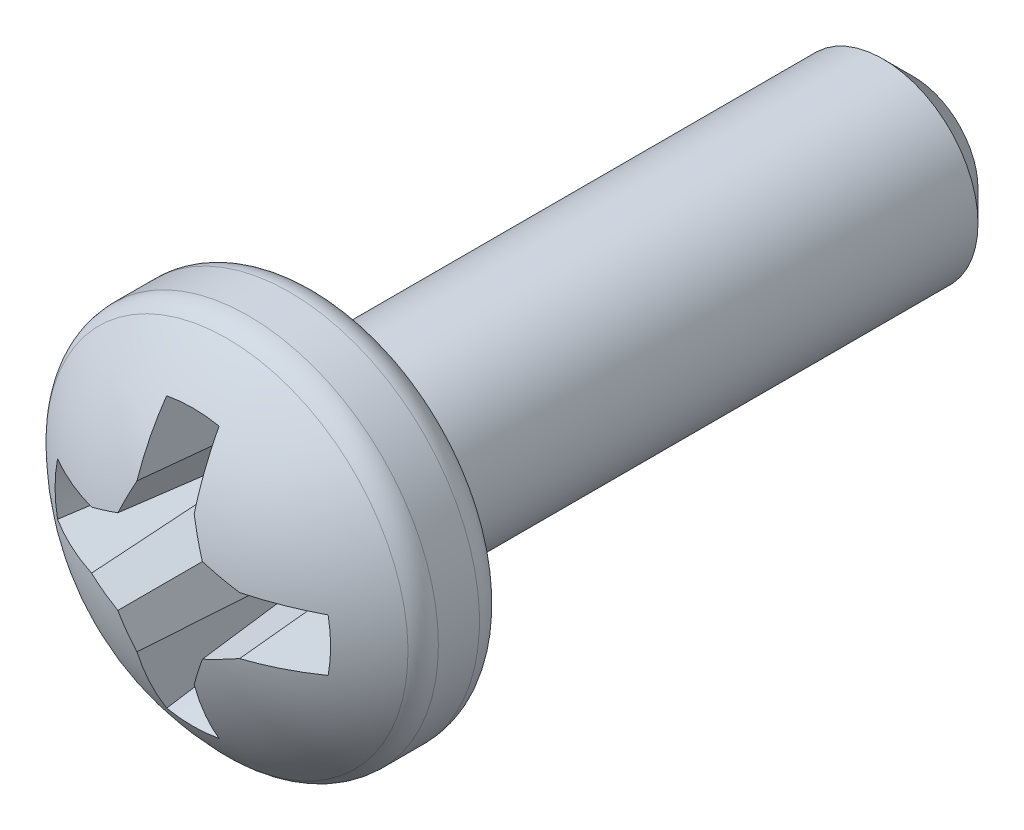
ISO-10303-21;
HEADER;
FILE_DESCRIPTION(('STEP AP214'),'2;1');
FILE_NAME('part.step','',(''),(''),'','','');
FILE_SCHEMA(('AUTOMOTIVE_DESIGN { 1 0 10303 214 1 1 1 1 }'));
ENDSEC;
DATA;
#1=APPLICATION_CONTEXT('core data for automotive mechanical design processes');
#2=APPLICATION_PROTOCOL_DEFINITION('international standard','automotive_design',2000,#1);
#3=PRODUCT_CONTEXT('',#1,'mechanical');
#4=PRODUCT('Part','Part','',(#3));
#5=PRODUCT_RELATED_PRODUCT_CATEGORY('part','',(#4));
#6=PRODUCT_DEFINITION_FORMATION('','',#4);
#7=PRODUCT_DEFINITION_CONTEXT('part definition',#1,'design');
#8=PRODUCT_DEFINITION('design','',#6,#7);
#9=PRODUCT_DEFINITION_SHAPE('','',#8);
#10=(LENGTH_UNIT() NAMED_UNIT(*) SI_UNIT(.MILLI.,.METRE.));
#11=(NAMED_UNIT(*) PLANE_ANGLE_UNIT() SI_UNIT($,.RADIAN.));
#12=(NAMED_UNIT(*) SI_UNIT($,.STERADIAN.) SOLID_ANGLE_UNIT());
#13=UNCERTAINTY_MEASURE_WITH_UNIT(LENGTH_MEASURE(1.E-05),#10,'distance_accuracy_value','');
#14=(GEOMETRIC_REPRESENTATION_CONTEXT(3) GLOBAL_UNCERTAINTY_ASSIGNED_CONTEXT((#13)) GLOBAL_UNIT_ASSIGNED_CONTEXT((#10,
#11,#12)) REPRESENTATION_CONTEXT('',''));
#15=CARTESIAN_POINT('',(0.,0.,0.));
#16=DIRECTION('',(0.,0.,1.));
#17=DIRECTION('',(1.,0.,0.));
#18=AXIS2_PLACEMENT_3D('',#15,#16,#17);
#19=CARTESIAN_POINT('',(0.710478325384203,0.791461441644268,0.413196607862429));
#20=DIRECTION('',(0.,0.,1.));
#21=DIRECTION('',(1.,0.,0.));
#22=AXIS2_PLACEMENT_3D('',#19,#20,#21);
#23=PLANE('',#22);
#24=DIRECTION('',(0.382683432365081,-0.92387953251129,0.));
#25=VECTOR('',#24,1.);
#26=CARTESIAN_POINT('',(0.723792212154071,0.796976234112247,0.413196607862429));
#27=LINE('',#26,#25);
#28=CARTESIAN_POINT('',(0.716221966738697,0.815252423264536,0.413196607862429));
#29=VERTEX_POINT('',#28);
#30=CARTESIAN_POINT('',(0.721507910320162,0.802491026580226,0.413196607862429));
#31=VERTEX_POINT('',#30);
#32=EDGE_CURVE('E292',#29,#31,#27,.T.);
#33=ORIENTED_EDGE('',*,*,#32,.F.);
#34=DIRECTION('',(0.,1.,0.));
#35=VECTOR('',#34,1.);
#36=CARTESIAN_POINT('',(0.716221966738698,0.791461441644268,0.413196607862429));
#37=LINE('',#36,#35);
#38=CARTESIAN_POINT('',(0.716221966738698,0.827667770303817,0.413196607862429));
#39=VERTEX_POINT('',#38);
#40=EDGE_CURVE('E168',#39,#29,#37,.F.);
#41=ORIENTED_EDGE('',*,*,#40,.F.);
#42=CARTESIAN_POINT('',(0.710478325384203,0.791461441644268,0.413196607862429));
#43=DIRECTION('',(0.,0.,1.));
#44=DIRECTION('',(1.,0.,0.));
#45=AXIS2_PLACEMENT_3D('',#42,#43,#44);
#46=CIRCLE('',#45,0.0366590732426823);
#47=CARTESIAN_POINT('',(0.704734684029712,0.827667770303818,0.413196607862429));
#48=VERTEX_POINT('',#47);
#49=EDGE_CURVE('E159',#39,#48,#46,.T.);
#50=ORIENTED_EDGE('',*,*,#49,.T.);
#51=DIRECTION('',(0.,1.,0.));
#52=VECTOR('',#51,1.);
#53=CARTESIAN_POINT('',(0.704734684029713,0.791461441644271,0.413196607862429));
#54=LINE('',#53,#52);
#55=CARTESIAN_POINT('',(0.704734684029713,0.815252423264539,0.413196607862429));
#56=VERTEX_POINT('',#55);
#57=EDGE_CURVE('E166',#56,#48,#54,.T.);
#58=ORIENTED_EDGE('',*,*,#57,.F.);
#59=DIRECTION('',(0.382683432365079,0.923879532511291,0.));
#60=VECTOR('',#59,1.);
#61=CARTESIAN_POINT('',(0.697164438614339,0.79697623411225,0.413196607862429));
#62=LINE('',#61,#60);
#63=CARTESIAN_POINT('',(0.699448740448248,0.802491026580229,0.413196607862429));
#64=VERTEX_POINT('',#63);
#65=EDGE_CURVE('E301',#64,#56,#62,.T.);
#66=ORIENTED_EDGE('',*,*,#65,.F.);
#67=DIRECTION('',(0.923879532511289,0.382683432365086,0.));
#68=VECTOR('',#67,1.);
#69=CARTESIAN_POINT('',(0.704963532916228,0.804775328414139,0.413196607862429));
#70=LINE('',#69,#68);
#71=CARTESIAN_POINT('',(0.686687343763938,0.797205082998765,0.413196607862429));
#72=VERTEX_POINT('',#71);
#73=EDGE_CURVE('E307',#72,#64,#70,.T.);
#74=ORIENTED_EDGE('',*,*,#73,.F.);
#75=DIRECTION('',(1.,0.,0.));
#76=VECTOR('',#75,1.);
#77=CARTESIAN_POINT('',(0.710478325384207,0.797205082998765,0.413196607862429));
#78=LINE('',#77,#76);
#79=CARTESIAN_POINT('',(0.674271996676527,0.797205082997996,0.413196607853642));
#80=VERTEX_POINT('',#79);
#81=EDGE_CURVE('E313',#80,#72,#78,.T.);
#82=ORIENTED_EDGE('',*,*,#81,.F.);
#83=CARTESIAN_POINT('',(0.710478325384206,0.791461441644271,0.413196607862429));
#84=DIRECTION('',(0.,0.,1.));
#85=DIRECTION('',(1.,0.,0.));
#86=AXIS2_PLACEMENT_3D('',#83,#84,#85);
#87=CIRCLE('',#86,0.0366590732924525);
#88=CARTESIAN_POINT('',(0.674271996674264,0.78571780028978,0.413196607862429));
#89=VERTEX_POINT('',#88);
#90=EDGE_CURVE('E410',#80,#89,#87,.T.);
#91=ORIENTED_EDGE('',*,*,#90,.T.);
#92=DIRECTION('',(1.,0.,0.));
#93=VECTOR('',#92,1.);
#94=CARTESIAN_POINT('',(0.710478325384203,0.78571780028978,0.413196607862429));
#95=LINE('',#94,#93);
#96=CARTESIAN_POINT('',(0.686687343763935,0.78571780028978,0.413196607862429));
#97=VERTEX_POINT('',#96);
#98=EDGE_CURVE('E247',#97,#89,#95,.F.);
#99=ORIENTED_EDGE('',*,*,#98,.F.);
#100=DIRECTION('',(-0.923879532511292,0.382683432365076,0.));
#101=VECTOR('',#100,1.);
#102=CARTESIAN_POINT('',(0.704963532916224,0.778147554874406,0.413196607862429));
#103=LINE('',#102,#101);
#104=CARTESIAN_POINT('',(0.699448740448245,0.780431856708316,0.413196607862429));
#105=VERTEX_POINT('',#104);
#106=EDGE_CURVE('E248',#105,#97,#103,.T.);
#107=ORIENTED_EDGE('',*,*,#106,.F.);
#108=DIRECTION('',(-0.38268343236509,0.923879532511287,0.));
#109=VECTOR('',#108,1.);
#110=CARTESIAN_POINT('',(0.697164438614334,0.785946649176296,0.413196607862429));
#111=LINE('',#110,#109);
#112=CARTESIAN_POINT('',(0.704734684029709,0.767670460024005,0.413196607862429));
#113=VERTEX_POINT('',#112);
#114=EDGE_CURVE('E254',#113,#105,#111,.T.);
#115=ORIENTED_EDGE('',*,*,#114,.F.);
#116=DIRECTION('',(0.,1.,0.));
#117=VECTOR('',#116,1.);
#118=CARTESIAN_POINT('',(0.704734684029709,0.791461441644275,0.413196607862429));
#119=LINE('',#118,#117);
#120=CARTESIAN_POINT('',(0.70473468402971,0.755255112984727,0.413196607862429));
#121=VERTEX_POINT('',#120);
#122=EDGE_CURVE('E260',#121,#113,#119,.T.);
#123=ORIENTED_EDGE('',*,*,#122,.F.);
#124=CARTESIAN_POINT('',(0.710478325384204,0.791461441644275,0.413196607862429));
#125=DIRECTION('',(0.,0.,1.));
#126=DIRECTION('',(1.,0.,0.));
#127=AXIS2_PLACEMENT_3D('',#124,#125,#126);
#128=CIRCLE('',#127,0.0366590732426806);
#129=CARTESIAN_POINT('',(0.716221966738695,0.755255112984727,0.413196607862429));
#130=VERTEX_POINT('',#129);
#131=EDGE_CURVE('E336',#121,#130,#128,.T.);
#132=ORIENTED_EDGE('',*,*,#131,.T.);
#133=DIRECTION('',(0.,1.,0.));
#134=VECTOR('',#133,1.);
#135=CARTESIAN_POINT('',(0.716221966738694,0.791461441644272,0.413196607862429));
#136=LINE('',#135,#134);
#137=CARTESIAN_POINT('',(0.716221966738695,0.767670460024002,0.413196607862429));
#138=VERTEX_POINT('',#137);
#139=EDGE_CURVE('E266',#138,#130,#136,.F.);
#140=ORIENTED_EDGE('',*,*,#139,.F.);
#141=DIRECTION('',(-0.382683432365075,-0.923879532511293,0.));
#142=VECTOR('',#141,1.);
#143=CARTESIAN_POINT('',(0.723792212154069,0.785946649176293,0.413196607862429));
#144=LINE('',#143,#142);
#145=CARTESIAN_POINT('',(0.721507910320159,0.780431856708313,0.413196607862429));
#146=VERTEX_POINT('',#145);
#147=EDGE_CURVE('E267',#146,#138,#144,.T.);
#148=ORIENTED_EDGE('',*,*,#147,.F.);
#149=DIRECTION('',(-0.923879532511286,-0.382683432365092,0.));
#150=VECTOR('',#149,1.);
#151=CARTESIAN_POINT('',(0.715993117852179,0.778147554874402,0.413196607862429));
#152=LINE('',#151,#150);
#153=CARTESIAN_POINT('',(0.734269307004469,0.785717800289777,0.413196607862429));
#154=VERTEX_POINT('',#153);
#155=EDGE_CURVE('E273',#154,#146,#152,.T.);
#156=ORIENTED_EDGE('',*,*,#155,.F.);
#157=DIRECTION('',(1.,0.,0.));
#158=VECTOR('',#157,1.);
#159=CARTESIAN_POINT('',(0.7104783253842,0.785717800289777,0.413196607862429));
#160=LINE('',#159,#158);
#161=CARTESIAN_POINT('',(0.746684654043753,0.785717800289777,0.413196607862429));
#162=VERTEX_POINT('',#161);
#163=EDGE_CURVE('E279',#162,#154,#160,.F.);
#164=ORIENTED_EDGE('',*,*,#163,.F.);
#165=CARTESIAN_POINT('',(0.710478325384203,0.791461441644268,0.413196607862429));
#166=DIRECTION('',(0.,0.,1.));
#167=DIRECTION('',(1.,0.,0.));
#168=AXIS2_PLACEMENT_3D('',#165,#166,#167);
#169=CIRCLE('',#168,0.0366590732426823);
#170=CARTESIAN_POINT('',(0.746684654043752,0.797205082998762,0.413196607862429));
#171=VERTEX_POINT('',#170);
#172=EDGE_CURVE('E492',#162,#171,#169,.T.);
#173=ORIENTED_EDGE('',*,*,#172,.T.);
#174=DIRECTION('',(1.,0.,0.));
#175=VECTOR('',#174,1.);
#176=CARTESIAN_POINT('',(0.710478325384203,0.797205082998762,0.413196607862429));
#177=LINE('',#176,#175);
#178=CARTESIAN_POINT('',(0.734269307004472,0.797205082998762,0.413196607862429));
#179=VERTEX_POINT('',#178);
#180=EDGE_CURVE('E285',#179,#171,#177,.T.);
#181=ORIENTED_EDGE('',*,*,#180,.F.);
#182=DIRECTION('',(0.92387953251129,-0.382683432365083,0.));
#183=VECTOR('',#182,1.);
#184=CARTESIAN_POINT('',(0.715993117852182,0.804775328414136,0.413196607862429));
#185=LINE('',#184,#183);
#186=EDGE_CURVE('E286',#31,#179,#185,.T.);
#187=ORIENTED_EDGE('',*,*,#186,.F.);
#188=EDGE_LOOP('',(#33,#41,#50,#58,#66,#74,#82,#91,#99,#107,#115,#123,#132,#140,#148,#156,#164,
#173,#181,#187));
#189=FACE_BOUND('',#188,.T.);
#190=ADVANCED_FACE('F17',(#189),#23,.T.);
#191=CARTESIAN_POINT('',(0.710478325384207,0.801303961329311,0.460047001563216));
#192=DIRECTION('',(0.,-0.996194698091744,0.0871557427476727));
#193=DIRECTION('',(0.,-0.0871557427476727,-0.996194698091744));
#194=AXIS2_PLACEMENT_3D('',#191,#192,#193);
#195=PLANE('',#194);
#196=DIRECTION('',(0.0173337504938649,-0.0871426484044482,-0.996045029063885));
#197=VECTOR('',#196,1.);
#198=CARTESIAN_POINT('',(0.685943943259578,0.8009424097128,0.455914447676356));
#199=LINE('',#198,#197);
#200=CARTESIAN_POINT('',(0.685943943259578,0.8009424097128,0.455914447676356));
#201=VERTEX_POINT('',#200);
#202=EDGE_CURVE('E310',#201,#72,#199,.T.);
#203=ORIENTED_EDGE('',*,*,#202,.F.);
#204=CARTESIAN_POINT('',(0.6656306923124,0.80015108887588,0.446869609122098));
#205=CARTESIAN_POINT('',(0.668819051995565,0.800321424804083,0.448816557690383));
#206=CARTESIAN_POINT('',(0.672106002749407,0.800472536171256,0.450543768520713));
#207=CARTESIAN_POINT('',(0.678877086398445,0.800736309783544,0.453558714705461));
#208=CARTESIAN_POINT('',(0.682361219293641,0.800848972028658,0.45484645005988));
#209=CARTESIAN_POINT('',(0.685943943259514,0.800942409712743,0.455914447676343));
#210=B_SPLINE_CURVE_WITH_KNOTS('',3,(#204,#205,#206,#207,#208,#209),.UNSPECIFIED.,.F.,.F.,(4,2,
4),(0.,0.0111485978671279,0.0222971957342559),.UNSPECIFIED.);
#211=CARTESIAN_POINT('',(0.665630692322977,0.800151088874493,0.446869609106245));
#212=VERTEX_POINT('',#211);
#213=EDGE_CURVE('E409',#212,#201,#210,.T.);
#214=ORIENTED_EDGE('',*,*,#213,.F.);
#215=CARTESIAN_POINT('',(0.665630692333555,0.800151088873107,0.446869609090391));
#216=CARTESIAN_POINT('',(0.667067160111317,0.79966000435443,0.441256487356838));
#217=CARTESIAN_POINT('',(0.668505502686871,0.799168961608414,0.435643843086986));
#218=CARTESIAN_POINT('',(0.671385937468524,0.798186959649785,0.424419509338453));
#219=CARTESIAN_POINT('',(0.672828029674714,0.797696000437175,0.418807819859794));
#220=CARTESIAN_POINT('',(0.674271996678788,0.797205082997228,0.41319660784486));
#221=B_SPLINE_CURVE_WITH_KNOTS('',3,(#215,#216,#217,#218,#219,#220),.UNSPECIFIED.,.F.,.F.,(4,2,
4),(0.,0.0174443558891329,0.0348887122017161),.UNSPECIFIED.);
#222=EDGE_CURVE('E318',#212,#80,#221,.T.);
#223=ORIENTED_EDGE('',*,*,#222,.T.);
#224=ORIENTED_EDGE('',*,*,#81,.T.);
#225=EDGE_LOOP('',(#203,#214,#223,#224));
#226=FACE_BOUND('',#225,.T.);
#227=ADVANCED_FACE('F427',(#226),#195,.T.);
#228=CARTESIAN_POINT('',(0.703394960087848,0.808562198209984,0.460047001563216));
#229=DIRECTION('',(0.381227206369649,-0.920363891963225,0.0871557427476661));
#230=DIRECTION('',(0.923879532511289,0.382683432365086,0.));
#231=AXIS2_PLACEMENT_3D('',#228,#229,#230);
#232=PLANE('',#231);
#233=DIRECTION('',(0.0666626913468223,-0.0666626913468416,-0.995546167269401));
#234=VECTOR('',#233,1.);
#235=CARTESIAN_POINT('',(0.696466961696687,0.805472805331791,0.457726739301586));
#236=LINE('',#235,#234);
#237=CARTESIAN_POINT('',(0.696466961696687,0.805472805331791,0.457726739301586));
#238=VERTEX_POINT('',#237);
#239=EDGE_CURVE('E304',#238,#64,#236,.T.);
#240=ORIENTED_EDGE('',*,*,#239,.F.);
#241=CARTESIAN_POINT('',(0.685943943259578,0.8009424097128,0.455914447676356));
#242=CARTESIAN_POINT('',(0.687674312814513,0.801700049456702,0.456346321822599));
#243=CARTESIAN_POINT('',(0.689416415795073,0.802456402296903,0.456713283197823));
#244=CARTESIAN_POINT('',(0.692924088607443,0.8039665341699,0.457317380406233));
#245=CARTESIAN_POINT('',(0.694689658439253,0.804720313202697,0.457554516239419));
#246=CARTESIAN_POINT('',(0.696466961696687,0.805472805331791,0.457726739301586));
#247=B_SPLINE_CURVE_WITH_KNOTS('',3,(#241,#242,#243,#244,#245,#246),.UNSPECIFIED.,.F.,.F.,(4,2,
4),(0.,0.00580300590917787,0.0116060118183554),.UNSPECIFIED.);
#248=EDGE_CURVE('E439',#201,#238,#247,.T.);
#249=ORIENTED_EDGE('',*,*,#248,.F.);
#250=ORIENTED_EDGE('',*,*,#202,.T.);
#251=ORIENTED_EDGE('',*,*,#73,.T.);
#252=EDGE_LOOP('',(#240,#249,#250,#251));
#253=FACE_BOUND('',#252,.T.);
#254=ADVANCED_FACE('F431',(#253),#232,.T.);
#255=CARTESIAN_POINT('',(0.693377568818494,0.79854480694063,0.460047001563216));
#256=DIRECTION('',(0.920363891963229,-0.381227206369643,0.0871557427476506));
#257=DIRECTION('',(0.382683432365079,0.923879532511291,0.));
#258=AXIS2_PLACEMENT_3D('',#255,#256,#257);
#259=PLANE('',#258);
#260=DIRECTION('',(0.0871426484044276,-0.0173337504938855,-0.996045029063886));
#261=VECTOR('',#260,1.);
#262=CARTESIAN_POINT('',(0.700997357315678,0.8159958237689,0.455914447676355));
#263=LINE('',#262,#261);
#264=CARTESIAN_POINT('',(0.700997357315678,0.8159958237689,0.455914447676355));
#265=VERTEX_POINT('',#264);
#266=EDGE_CURVE('E176',#265,#56,#263,.T.);
#267=ORIENTED_EDGE('',*,*,#266,.F.);
#268=CARTESIAN_POINT('',(0.696466961696687,0.805472805331791,0.457726739301586));
#269=CARTESIAN_POINT('',(0.697219453825782,0.807250108589226,0.457554516239419));
#270=CARTESIAN_POINT('',(0.697973232858578,0.809015678421036,0.457317380406232));
#271=CARTESIAN_POINT('',(0.699483364731575,0.812523351233405,0.456713283197822));
#272=CARTESIAN_POINT('',(0.700239717571775,0.814265454213965,0.456346321822598));
#273=CARTESIAN_POINT('',(0.700997357315678,0.8159958237689,0.455914447676355));
#274=B_SPLINE_CURVE_WITH_KNOTS('',3,(#268,#269,#270,#271,#272,#273),.UNSPECIFIED.,.F.,.F.,(4,2,
4),(0.,0.00580300590917771,0.0116060118183554),.UNSPECIFIED.);
#275=EDGE_CURVE('E445',#238,#265,#274,.T.);
#276=ORIENTED_EDGE('',*,*,#275,.F.);
#277=ORIENTED_EDGE('',*,*,#239,.T.);
#278=ORIENTED_EDGE('',*,*,#65,.T.);
#279=EDGE_LOOP('',(#267,#276,#277,#278));
#280=FACE_BOUND('',#279,.T.);
#281=ADVANCED_FACE('F436',(#280),#259,.T.);
#282=CARTESIAN_POINT('',(0.700635805699168,0.791461441644271,0.460047001563216));
#283=DIRECTION('',(0.996194698091747,0.,0.0871557427476441));
#284=DIRECTION('',(0.0871557427476441,0.,-0.996194698091747));
#285=AXIS2_PLACEMENT_3D('',#282,#283,#284);
#286=PLANE('',#285);
#287=CARTESIAN_POINT('',(0.704734684027888,0.827667770309186,0.413196607883283));
#288=CARTESIAN_POINT('',(0.704243766588092,0.829111737320114,0.41880781989649));
#289=CARTESIAN_POINT('',(0.703752807375633,0.830553829533185,0.424419509373417));
#290=CARTESIAN_POINT('',(0.702770805417309,0.833434264328652,0.43564384311848));
#291=CARTESIAN_POINT('',(0.702279762671445,0.834872606911139,0.441256487386592));
#292=CARTESIAN_POINT('',(0.701788678152921,0.836309074695859,0.446869609118402));
#293=B_SPLINE_CURVE_WITH_KNOTS('',3,(#287,#288,#289,#290,#291,#292),.UNSPECIFIED.,.F.,.F.,(4,2,
4),(0.,0.0174443563126523,0.0348887122018541),.UNSPECIFIED.);
#294=CARTESIAN_POINT('',(0.701788678153434,0.836309074694357,0.446869609112536));
#295=VERTEX_POINT('',#294);
#296=EDGE_CURVE('E170',#48,#295,#293,.T.);
#297=ORIENTED_EDGE('',*,*,#296,.T.);
#298=CARTESIAN_POINT('',(0.700997357315678,0.8159958237689,0.455914447676355));
#299=CARTESIAN_POINT('',(0.701090794999738,0.819578547732721,0.454846450060513));
#300=CARTESIAN_POINT('',(0.701203457244796,0.823062680625994,0.453558714706955));
#301=CARTESIAN_POINT('',(0.701467230856907,0.829833764271441,0.45054376852441));
#302=CARTESIAN_POINT('',(0.701618342223961,0.833120715023616,0.448816557695422));
#303=CARTESIAN_POINT('',(0.701788678152013,0.836309074705242,0.446869609128719));
#304=B_SPLINE_CURVE_WITH_KNOTS('',3,(#298,#299,#300,#301,#302,#303),.UNSPECIFIED.,.F.,.F.,(4,2,
4),(0.,0.0111485978608173,0.0222971957216349),.UNSPECIFIED.);
#305=EDGE_CURVE('E450',#265,#295,#304,.T.);
#306=ORIENTED_EDGE('',*,*,#305,.F.);
#307=ORIENTED_EDGE('',*,*,#266,.T.);
#308=ORIENTED_EDGE('',*,*,#57,.T.);
#309=EDGE_LOOP('',(#297,#306,#307,#308));
#310=FACE_BOUND('',#309,.T.);
#311=ADVANCED_FACE('F173',(#310),#286,.T.);
#312=CARTESIAN_POINT('',(0.710478325384203,0.791461441644268,0.446869608992984));
#313=DIRECTION('',(0.,0.,1.));
#314=DIRECTION('',(1.,0.,0.));
#315=AXIS2_PLACEMENT_3D('',#312,#313,#314);
#316=CONICAL_SURFACE('',#315,0.0456817267215669,0.261799388331704);
#317=ORIENTED_EDGE('',*,*,#296,.F.);
#318=ORIENTED_EDGE('',*,*,#49,.F.);
#319=CARTESIAN_POINT('',(0.719167972616199,0.836309074697934,0.446869609126514));
#320=CARTESIAN_POINT('',(0.718676888097417,0.83487260691246,0.441256487391751));
#321=CARTESIAN_POINT('',(0.718185845351295,0.833434264329218,0.435643843120687));
#322=CARTESIAN_POINT('',(0.717203843392454,0.830553829532235,0.42441950936972));
#323=CARTESIAN_POINT('',(0.716712884179737,0.829111737318405,0.418807819889842));
#324=CARTESIAN_POINT('',(0.716221966739682,0.827667770306714,0.413196607873684));
#325=B_SPLINE_CURVE_WITH_KNOTS('',3,(#319,#320,#321,#322,#323,#324),.UNSPECIFIED.,.F.,.F.,(4,2,
4),(0.,0.0174443558983771,0.0348887122202045),.UNSPECIFIED.);
#326=CARTESIAN_POINT('',(0.719167972616323,0.83630907470108,0.446869609127927));
#327=VERTEX_POINT('',#326);
#328=EDGE_CURVE('E182',#327,#39,#325,.T.);
#329=ORIENTED_EDGE('',*,*,#328,.F.);
#330=CARTESIAN_POINT('',(0.710478325384203,0.791461441644268,0.44686960910667));
#331=DIRECTION('',(0.,0.,1.));
#332=DIRECTION('',(1.,0.,0.));
#333=AXIS2_PLACEMENT_3D('',#330,#331,#332);
#334=CIRCLE('',#333,0.0456817267520292);
#335=EDGE_CURVE('E180',#295,#327,#334,.F.);
#336=ORIENTED_EDGE('',*,*,#335,.F.);
#337=EDGE_LOOP('',(#317,#318,#329,#336));
#338=FACE_BOUND('',#337,.T.);
#339=ADVANCED_FACE('F178',(#338),#316,.F.);
#340=CARTESIAN_POINT('',(0.720320845069243,0.791461441644268,0.460047001563216));
#341=DIRECTION('',(-0.996194698091746,0.,0.0871557427476584));
#342=DIRECTION('',(0.0871557427476584,0.,0.996194698091746));
#343=AXIS2_PLACEMENT_3D('',#340,#341,#342);
#344=PLANE('',#343);
#345=DIRECTION('',(-0.0871426484044405,-0.0173337504938649,-0.996045029063885));
#346=VECTOR('',#345,1.);
#347=CARTESIAN_POINT('',(0.719959293452732,0.815995823768896,0.455914447676356));
#348=LINE('',#347,#346);
#349=CARTESIAN_POINT('',(0.719959293452732,0.815995823768896,0.455914447676356));
#350=VERTEX_POINT('',#349);
#351=EDGE_CURVE('E295',#350,#29,#348,.T.);
#352=ORIENTED_EDGE('',*,*,#351,.F.);
#353=CARTESIAN_POINT('',(0.719167972616446,0.836309074704226,0.44686960912934));
#354=CARTESIAN_POINT('',(0.719338308544487,0.833120715022747,0.448816557695893));
#355=CARTESIAN_POINT('',(0.719489419911532,0.829833764270731,0.450543768524754));
#356=CARTESIAN_POINT('',(0.719753193523629,0.823062680625626,0.45355871470709));
#357=CARTESIAN_POINT('',(0.719865855768681,0.819578547732536,0.454846450060566));
#358=CARTESIAN_POINT('',(0.719959293452738,0.81599582376891,0.45591444767635));
#359=B_SPLINE_CURVE_WITH_KNOTS('',3,(#353,#354,#355,#356,#357,#358),.UNSPECIFIED.,.F.,.F.,(4,2,
4),(0.,0.0111485978602174,0.0222971957204347),.UNSPECIFIED.);
#360=EDGE_CURVE('E210',#327,#350,#359,.T.);
#361=ORIENTED_EDGE('',*,*,#360,.F.);
#362=ORIENTED_EDGE('',*,*,#328,.T.);
#363=ORIENTED_EDGE('',*,*,#40,.T.);
#364=EDGE_LOOP('',(#352,#361,#362,#363));
#365=FACE_BOUND('',#364,.T.);
#366=ADVANCED_FACE('F199',(#365),#344,.T.);
#367=CARTESIAN_POINT('',(0.727579081949916,0.798544806940627,0.460047001563216));
#368=DIRECTION('',(-0.920363891963228,-0.381227206369645,0.0871557427476584));
#369=DIRECTION('',(0.382683432365081,-0.92387953251129,0.));
#370=AXIS2_PLACEMENT_3D('',#367,#368,#369);
#371=PLANE('',#370);
#372=DIRECTION('',(-0.0666626913468174,-0.0666626913468417,-0.995546167269401));
#373=VECTOR('',#372,1.);
#374=CARTESIAN_POINT('',(0.724489689071723,0.805472805331788,0.457726739301586));
#375=LINE('',#374,#373);
#376=CARTESIAN_POINT('',(0.724489689071723,0.805472805331788,0.457726739301586));
#377=VERTEX_POINT('',#376);
#378=EDGE_CURVE('E289',#377,#31,#375,.T.);
#379=ORIENTED_EDGE('',*,*,#378,.F.);
#380=CARTESIAN_POINT('',(0.719959293452732,0.815995823768896,0.455914447676356));
#381=CARTESIAN_POINT('',(0.720716933196635,0.814265454213961,0.456346321822598));
#382=CARTESIAN_POINT('',(0.721473286036835,0.812523351233401,0.456713283197823));
#383=CARTESIAN_POINT('',(0.722983417909832,0.809015678421032,0.457317380406233));
#384=CARTESIAN_POINT('',(0.723737196942629,0.807250108589223,0.457554516239419));
#385=CARTESIAN_POINT('',(0.724489689071723,0.805472805331788,0.457726739301586));
#386=B_SPLINE_CURVE_WITH_KNOTS('',3,(#380,#381,#382,#383,#384,#385),.UNSPECIFIED.,.F.,.F.,(4,2,
4),(0.,0.00580300590917684,0.0116060118183539),.UNSPECIFIED.);
#387=EDGE_CURVE('E218',#350,#377,#386,.T.);
#388=ORIENTED_EDGE('',*,*,#387,.F.);
#389=ORIENTED_EDGE('',*,*,#351,.T.);
#390=ORIENTED_EDGE('',*,*,#32,.T.);
#391=EDGE_LOOP('',(#379,#388,#389,#390));
#392=FACE_BOUND('',#391,.T.);
#393=ADVANCED_FACE('F204',(#392),#371,.T.);
#394=CARTESIAN_POINT('',(0.717561690680562,0.808562198209981,0.460047001563216));
#395=DIRECTION('',(-0.381227206369647,-0.920363891963227,0.0871557427476583));
#396=DIRECTION('',(0.92387953251129,-0.382683432365083,0.));
#397=AXIS2_PLACEMENT_3D('',#394,#395,#396);
#398=PLANE('',#397);
#399=DIRECTION('',(-0.0173337504938598,-0.0871426484044405,-0.996045029063885));
#400=VECTOR('',#399,1.);
#401=CARTESIAN_POINT('',(0.735012707508832,0.800942409712797,0.455914447676356));
#402=LINE('',#401,#400);
#403=CARTESIAN_POINT('',(0.735012707508832,0.800942409712797,0.455914447676356));
#404=VERTEX_POINT('',#403);
#405=EDGE_CURVE('E282',#404,#179,#402,.T.);
#406=ORIENTED_EDGE('',*,*,#405,.F.);
#407=CARTESIAN_POINT('',(0.724489689071723,0.805472805331788,0.457726739301586));
#408=CARTESIAN_POINT('',(0.726266992329158,0.804720313202693,0.457554516239419));
#409=CARTESIAN_POINT('',(0.728032562160967,0.803966534169897,0.457317380406233));
#410=CARTESIAN_POINT('',(0.731540234973337,0.8024564022969,0.456713283197822));
#411=CARTESIAN_POINT('',(0.733282337953897,0.801700049456699,0.456346321822598));
#412=CARTESIAN_POINT('',(0.735012707508832,0.800942409712797,0.455914447676355));
#413=B_SPLINE_CURVE_WITH_KNOTS('',3,(#407,#408,#409,#410,#411,#412),.UNSPECIFIED.,.F.,.F.,(4,2,
4),(0.,0.0058030059091779,0.0116060118183555),.UNSPECIFIED.);
#414=EDGE_CURVE('E462',#377,#404,#413,.T.);
#415=ORIENTED_EDGE('',*,*,#414,.F.);
#416=ORIENTED_EDGE('',*,*,#378,.T.);
#417=ORIENTED_EDGE('',*,*,#186,.T.);
#418=EDGE_LOOP('',(#406,#415,#416,#417));
#419=FACE_BOUND('',#418,.T.);
#420=ADVANCED_FACE('F474',(#419),#398,.T.);
#421=CARTESIAN_POINT('',(0.710478325384203,0.801303961329307,0.460047001563216));
#422=DIRECTION('',(0.,-0.996194698091746,0.0871557427476584));
#423=DIRECTION('',(0.,-0.0871557427476584,-0.996194698091746));
#424=AXIS2_PLACEMENT_3D('',#421,#422,#423);
#425=PLANE('',#424);
#426=CARTESIAN_POINT('',(0.746684654048905,0.797205083000513,0.413196607882447));
#427=CARTESIAN_POINT('',(0.74812862105987,0.797696000440322,0.418807819895793));
#428=CARTESIAN_POINT('',(0.749570713272976,0.798186959652792,0.42441950937286));
#429=CARTESIAN_POINT('',(0.752451148068515,0.799168961611141,0.435643843118201));
#430=CARTESIAN_POINT('',(0.753889490651037,0.799660004357017,0.441256487386453));
#431=CARTESIAN_POINT('',(0.755325958435793,0.800151088875554,0.446869609118402));
#432=B_SPLINE_CURVE_WITH_KNOTS('',3,(#426,#427,#428,#429,#430,#431),.UNSPECIFIED.,.F.,.F.,(4,2,
4),(0.,0.0174443563130851,0.0348887122027198),.UNSPECIFIED.);
#433=CARTESIAN_POINT('',(0.755325958434291,0.80015108887504,0.446869609112536));
#434=VERTEX_POINT('',#433);
#435=EDGE_CURVE('E351',#171,#434,#432,.T.);
#436=ORIENTED_EDGE('',*,*,#435,.T.);
#437=CARTESIAN_POINT('',(0.735012707508832,0.800942409712797,0.455914447676355));
#438=CARTESIAN_POINT('',(0.738595431472666,0.800848972028756,0.454846450060507));
#439=CARTESIAN_POINT('',(0.742079564365951,0.800736309783698,0.453558714706944));
#440=CARTESIAN_POINT('',(0.748850648011421,0.800472536171546,0.45054376852439));
#441=CARTESIAN_POINT('',(0.752137598763607,0.800321424804453,0.448816557695398));
#442=CARTESIAN_POINT('',(0.755325958445243,0.800151088876342,0.446869609128692));
#443=B_SPLINE_CURVE_WITH_KNOTS('',3,(#437,#438,#439,#440,#441,#442),.UNSPECIFIED.,.F.,.F.,(4,2,
4),(0.,0.0111485978608569,0.022297195721714),.UNSPECIFIED.);
#444=EDGE_CURVE('E463',#404,#434,#443,.T.);
#445=ORIENTED_EDGE('',*,*,#444,.F.);
#446=ORIENTED_EDGE('',*,*,#405,.T.);
#447=ORIENTED_EDGE('',*,*,#180,.T.);
#448=EDGE_LOOP('',(#436,#445,#446,#447));
#449=FACE_BOUND('',#448,.T.);
#450=ADVANCED_FACE('F477',(#449),#425,.T.);
#451=CARTESIAN_POINT('',(0.710478325384203,0.791461441644268,0.446869608992984));
#452=DIRECTION('',(0.,0.,1.));
#453=DIRECTION('',(1.,0.,0.));
#454=AXIS2_PLACEMENT_3D('',#451,#452,#453);
#455=CONICAL_SURFACE('',#454,0.0456817267215669,0.261799388331704);
#456=ORIENTED_EDGE('',*,*,#172,.F.);
#457=CARTESIAN_POINT('',(0.75532595843787,0.782771794412276,0.446869609126514));
#458=CARTESIAN_POINT('',(0.75388949065236,0.783262878931071,0.441256487391612));
#459=CARTESIAN_POINT('',(0.752451148069082,0.783753921677205,0.435643843120409));
#460=CARTESIAN_POINT('',(0.749570713272028,0.78473592363607,0.424419509369165));
#461=CARTESIAN_POINT('',(0.748128621058162,0.785226882848799,0.418807819889148));
#462=CARTESIAN_POINT('',(0.746684654046435,0.785717800288865,0.413196607872851));
#463=B_SPLINE_CURVE_WITH_KNOTS('',3,(#457,#458,#459,#460,#461,#462),.UNSPECIFIED.,.F.,.F.,(4,2,
4),(0.,0.0174443558988088,0.0348887122210679),.UNSPECIFIED.);
#464=CARTESIAN_POINT('',(0.755325958441016,0.782771794412152,0.446869609127927));
#465=VERTEX_POINT('',#464);
#466=EDGE_CURVE('E346',#465,#162,#463,.T.);
#467=ORIENTED_EDGE('',*,*,#466,.F.);
#468=CARTESIAN_POINT('',(0.710478325384203,0.791461441644268,0.44686960910667));
#469=DIRECTION('',(0.,0.,1.));
#470=DIRECTION('',(1.,0.,0.));
#471=AXIS2_PLACEMENT_3D('',#468,#469,#470);
#472=CIRCLE('',#471,0.0456817267520292);
#473=EDGE_CURVE('E464',#434,#465,#472,.F.);
#474=ORIENTED_EDGE('',*,*,#473,.F.);
#475=ORIENTED_EDGE('',*,*,#435,.F.);
#476=EDGE_LOOP('',(#456,#467,#474,#475));
#477=FACE_BOUND('',#476,.T.);
#478=ADVANCED_FACE('F482',(#477),#455,.F.);
#479=CARTESIAN_POINT('',(0.7104783253842,0.781618921959232,0.460047001563216));
#480=DIRECTION('',(0.,0.996194698091747,0.0871557427476441));
#481=DIRECTION('',(0.,-0.0871557427476441,0.996194698091747));
#482=AXIS2_PLACEMENT_3D('',#479,#480,#481);
#483=PLANE('',#482);
#484=DIRECTION('',(-0.0173337504938417,0.0871426484044261,-0.996045029063887));
#485=VECTOR('',#484,1.);
#486=CARTESIAN_POINT('',(0.735012707508828,0.781980473575742,0.455914447676357));
#487=LINE('',#486,#485);
#488=CARTESIAN_POINT('',(0.735012707508828,0.781980473575742,0.455914447676357));
#489=VERTEX_POINT('',#488);
#490=EDGE_CURVE('E276',#489,#154,#487,.T.);
#491=ORIENTED_EDGE('',*,*,#490,.F.);
#492=CARTESIAN_POINT('',(0.755325958444162,0.782771794412029,0.44686960912934));
#493=CARTESIAN_POINT('',(0.752137598762689,0.782601458483978,0.448816557695888));
#494=CARTESIAN_POINT('',(0.748850648010681,0.782450347116934,0.450543768524745));
#495=CARTESIAN_POINT('',(0.742079564365591,0.782186573504858,0.45355871470708));
#496=CARTESIAN_POINT('',(0.738595431472509,0.782073911259826,0.454846450060557));
#497=CARTESIAN_POINT('',(0.735012707508892,0.7819804735758,0.455914447676344));
#498=B_SPLINE_CURVE_WITH_KNOTS('',3,(#492,#493,#494,#495,#496,#497),.UNSPECIFIED.,.F.,.F.,(4,2,
4),(0.,0.0111485978601939,0.0222971957203879),.UNSPECIFIED.);
#499=EDGE_CURVE('E509',#465,#489,#498,.T.);
#500=ORIENTED_EDGE('',*,*,#499,.F.);
#501=ORIENTED_EDGE('',*,*,#466,.T.);
#502=ORIENTED_EDGE('',*,*,#163,.T.);
#503=EDGE_LOOP('',(#491,#500,#501,#502));
#504=FACE_BOUND('',#503,.T.);
#505=ADVANCED_FACE('F499',(#504),#483,.T.);
#506=CARTESIAN_POINT('',(0.717561690680559,0.774360685078558,0.460047001563216));
#507=DIRECTION('',(-0.381227206369656,0.920363891963225,0.0871557427476397));
#508=DIRECTION('',(-0.923879532511286,-0.382683432365092,0.));
#509=AXIS2_PLACEMENT_3D('',#506,#507,#508);
#510=PLANE('',#509);
#511=DIRECTION('',(-0.0666626913468169,0.0666626913468218,-0.995546167269403));
#512=VECTOR('',#511,1.);
#513=CARTESIAN_POINT('',(0.72448968907172,0.777450077956752,0.457726739301588));
#514=LINE('',#513,#512);
#515=CARTESIAN_POINT('',(0.72448968907172,0.777450077956752,0.457726739301588));
#516=VERTEX_POINT('',#515);
#517=EDGE_CURVE('E270',#516,#146,#514,.T.);
#518=ORIENTED_EDGE('',*,*,#517,.F.);
#519=CARTESIAN_POINT('',(0.735012707508828,0.781980473575742,0.455914447676357));
#520=CARTESIAN_POINT('',(0.733282337953894,0.781222833831839,0.4563463218226));
#521=CARTESIAN_POINT('',(0.731540234973334,0.780466480991639,0.456713283197824));
#522=CARTESIAN_POINT('',(0.728032562160965,0.778956349118642,0.457317380406234));
#523=CARTESIAN_POINT('',(0.726266992329155,0.778202570085846,0.45755451623942));
#524=CARTESIAN_POINT('',(0.72448968907172,0.777450077956751,0.457726739301587));
#525=B_SPLINE_CURVE_WITH_KNOTS('',3,(#519,#520,#521,#522,#523,#524),.UNSPECIFIED.,.F.,.F.,(4,2,
4),(0.,0.0058030059091771,0.0116060118183543),.UNSPECIFIED.);
#526=EDGE_CURVE('E515',#489,#516,#525,.T.);
#527=ORIENTED_EDGE('',*,*,#526,.F.);
#528=ORIENTED_EDGE('',*,*,#490,.T.);
#529=ORIENTED_EDGE('',*,*,#155,.T.);
#530=EDGE_LOOP('',(#518,#527,#528,#529));
#531=FACE_BOUND('',#530,.T.);
#532=ADVANCED_FACE('F503',(#531),#510,.T.);
#533=CARTESIAN_POINT('',(0.727579081949913,0.784378076347913,0.460047001563216));
#534=DIRECTION('',(-0.920363891963232,0.381227206369639,0.0871557427476397));
#535=DIRECTION('',(-0.382683432365075,-0.923879532511293,0.));
#536=AXIS2_PLACEMENT_3D('',#533,#534,#535);
#537=PLANE('',#536);
#538=DIRECTION('',(-0.0871426484044258,0.0173337504938366,-0.996045029063887));
#539=VECTOR('',#538,1.);
#540=CARTESIAN_POINT('',(0.719959293452729,0.766927059519643,0.455914447676357));
#541=LINE('',#540,#539);
#542=CARTESIAN_POINT('',(0.719959293452729,0.766927059519643,0.455914447676357));
#543=VERTEX_POINT('',#542);
#544=EDGE_CURVE('E263',#543,#138,#541,.T.);
#545=ORIENTED_EDGE('',*,*,#544,.F.);
#546=CARTESIAN_POINT('',(0.72448968907172,0.777450077956752,0.457726739301587));
#547=CARTESIAN_POINT('',(0.723737196942626,0.775672774699317,0.45755451623942));
#548=CARTESIAN_POINT('',(0.722983417909829,0.773907204867507,0.457317380406234));
#549=CARTESIAN_POINT('',(0.721473286036832,0.770399532055138,0.456713283197824));
#550=CARTESIAN_POINT('',(0.720716933196632,0.768657429074578,0.4563463218226));
#551=CARTESIAN_POINT('',(0.719959293452729,0.766927059519643,0.455914447676357));
#552=B_SPLINE_CURVE_WITH_KNOTS('',3,(#546,#547,#548,#549,#550,#551),.UNSPECIFIED.,.F.,.F.,(4,2,
4),(0.,0.00580300590917774,0.0116060118183554),.UNSPECIFIED.);
#553=EDGE_CURVE('E535',#516,#543,#552,.T.);
#554=ORIENTED_EDGE('',*,*,#553,.F.);
#555=ORIENTED_EDGE('',*,*,#517,.T.);
#556=ORIENTED_EDGE('',*,*,#147,.T.);
#557=EDGE_LOOP('',(#545,#554,#555,#556));
#558=FACE_BOUND('',#557,.T.);
#559=ADVANCED_FACE('F548',(#558),#537,.T.);
#560=CARTESIAN_POINT('',(0.720320845069239,0.791461441644272,0.460047001563216));
#561=DIRECTION('',(-0.996194698091747,0.,0.0871557427476441));
#562=DIRECTION('',(0.0871557427476441,0.,0.996194698091747));
#563=AXIS2_PLACEMENT_3D('',#560,#561,#562);
#564=PLANE('',#563);
#565=CARTESIAN_POINT('',(0.716221966740519,0.755255112979358,0.413196607883283));
#566=CARTESIAN_POINT('',(0.716712884180309,0.753811145968103,0.418807819896422));
#567=CARTESIAN_POINT('',(0.717203843392762,0.752369053754704,0.42441950937328));
#568=CARTESIAN_POINT('',(0.718185845351075,0.74948861895858,0.435643843118207));
#569=CARTESIAN_POINT('',(0.718676888096932,0.748050276375763,0.441256487386251));
#570=CARTESIAN_POINT('',(0.71916797261545,0.746613808590712,0.446869609117992));
#571=B_SPLINE_CURVE_WITH_KNOTS('',3,(#565,#566,#567,#568,#569,#570),.UNSPECIFIED.,.F.,.F.,(4,2,
4),(0.,0.0174443563126973,0.0348887122019442),.UNSPECIFIED.);
#572=CARTESIAN_POINT('',(0.719167972614955,0.746613808592161,0.446869609112331));
#573=VERTEX_POINT('',#572);
#574=EDGE_CURVE('E559',#130,#573,#571,.T.);
#575=ORIENTED_EDGE('',*,*,#574,.T.);
#576=CARTESIAN_POINT('',(0.719959293452729,0.766927059519643,0.455914447676357));
#577=CARTESIAN_POINT('',(0.719865855768667,0.763344335555725,0.454846450060486));
#578=CARTESIAN_POINT('',(0.719753193523606,0.759860202662363,0.453558714706889));
#579=CARTESIAN_POINT('',(0.719489419911485,0.753089119016747,0.450543768524241));
#580=CARTESIAN_POINT('',(0.719338308544426,0.749802168264494,0.448816557695191));
#581=CARTESIAN_POINT('',(0.719167972616367,0.746613808582796,0.446869609128414));
#582=B_SPLINE_CURVE_WITH_KNOTS('',3,(#576,#577,#578,#579,#580,#581),.UNSPECIFIED.,.F.,.F.,(4,2,
4),(0.,0.0111485978611131,0.022297195722226),.UNSPECIFIED.);
#583=EDGE_CURVE('E536',#543,#573,#582,.T.);
#584=ORIENTED_EDGE('',*,*,#583,.F.);
#585=ORIENTED_EDGE('',*,*,#544,.T.);
#586=ORIENTED_EDGE('',*,*,#139,.T.);
#587=EDGE_LOOP('',(#575,#584,#585,#586));
#588=FACE_BOUND('',#587,.T.);
#589=ADVANCED_FACE('F551',(#588),#564,.T.);
#590=CARTESIAN_POINT('',(0.710478325384204,0.791461441644275,0.446869608879296));
#591=DIRECTION('',(0.,0.,1.));
#592=DIRECTION('',(1.,0.,0.));
#593=AXIS2_PLACEMENT_3D('',#590,#591,#592);
#594=CONICAL_SURFACE('',#593,0.0456817266931439,0.261799388388261);
#595=ORIENTED_EDGE('',*,*,#131,.F.);
#596=CARTESIAN_POINT('',(0.701788678152244,0.746613808588636,0.446869609126105));
#597=CARTESIAN_POINT('',(0.702279762671021,0.748050276374441,0.441256487391411));
#598=CARTESIAN_POINT('',(0.702770805417136,0.749488618958014,0.435643843120414));
#599=CARTESIAN_POINT('',(0.703752807375965,0.752369053755654,0.424419509369584));
#600=CARTESIAN_POINT('',(0.704243766588677,0.753811145969813,0.418807819889774));
#601=CARTESIAN_POINT('',(0.704734684028725,0.75525511298183,0.413196607873684));
#602=B_SPLINE_CURVE_WITH_KNOTS('',3,(#596,#597,#598,#599,#600,#601),.UNSPECIFIED.,.F.,.F.,(4,2,
4),(0.,0.0174443558984225,0.0348887122202953),.UNSPECIFIED.);
#603=CARTESIAN_POINT('',(0.701788678152116,0.746613808586223,0.44686960912757));
#604=VERTEX_POINT('',#603);
#605=EDGE_CURVE('E331',#604,#121,#602,.T.);
#606=ORIENTED_EDGE('',*,*,#605,.F.);
#607=CARTESIAN_POINT('',(0.710478325384204,0.791461441644275,0.44686960910667));
#608=DIRECTION('',(0.,0.,1.));
#609=DIRECTION('',(1.,0.,0.));
#610=AXIS2_PLACEMENT_3D('',#607,#608,#609);
#611=CIRCLE('',#610,0.0456817267540685);
#612=EDGE_CURVE('E538',#573,#604,#611,.F.);
#613=ORIENTED_EDGE('',*,*,#612,.F.);
#614=ORIENTED_EDGE('',*,*,#574,.F.);
#615=EDGE_LOOP('',(#595,#606,#613,#614));
#616=FACE_BOUND('',#615,.T.);
#617=ADVANCED_FACE('F555',(#616),#594,.F.);
#618=CARTESIAN_POINT('',(0.700635805699164,0.791461441644275,0.460047001563216));
#619=DIRECTION('',(0.996194698091746,0.,0.0871557427476584));
#620=DIRECTION('',(0.0871557427476584,0.,-0.996194698091746));
#621=AXIS2_PLACEMENT_3D('',#618,#619,#620);
#622=PLANE('',#621);
#623=DIRECTION('',(0.0871426484044389,0.0173337504938312,-0.996045029063886));
#624=VECTOR('',#623,1.);
#625=CARTESIAN_POINT('',(0.700997357315674,0.766927059519646,0.455914447676358));
#626=LINE('',#625,#624);
#627=CARTESIAN_POINT('',(0.700997357315674,0.766927059519646,0.455914447676358));
#628=VERTEX_POINT('',#627);
#629=EDGE_CURVE('E257',#628,#113,#626,.T.);
#630=ORIENTED_EDGE('',*,*,#629,.F.);
#631=CARTESIAN_POINT('',(0.701788678151988,0.74661380858381,0.446869609129035));
#632=CARTESIAN_POINT('',(0.701618342223941,0.749802168265362,0.448816557695661));
#633=CARTESIAN_POINT('',(0.701467230856891,0.753089119017456,0.450543768524585));
#634=CARTESIAN_POINT('',(0.701203457244784,0.759860202662729,0.453558714707024));
#635=CARTESIAN_POINT('',(0.701090794999728,0.763344335555909,0.45484645006054));
#636=CARTESIAN_POINT('',(0.700997357315669,0.766927059519632,0.455914447676352));
#637=B_SPLINE_CURVE_WITH_KNOTS('',3,(#631,#632,#633,#634,#635,#636),.UNSPECIFIED.,.F.,.F.,(4,2,
4),(0.,0.011148597860513,0.0222971957210259),.UNSPECIFIED.);
#638=EDGE_CURVE('E574',#604,#628,#637,.T.);
#639=ORIENTED_EDGE('',*,*,#638,.F.);
#640=ORIENTED_EDGE('',*,*,#605,.T.);
#641=ORIENTED_EDGE('',*,*,#122,.T.);
#642=EDGE_LOOP('',(#630,#639,#640,#641));
#643=FACE_BOUND('',#642,.T.);
#644=ADVANCED_FACE('F582',(#643),#622,.T.);
#645=CARTESIAN_POINT('',(0.69337756881849,0.784378076347916,0.460047001563216));
#646=DIRECTION('',(0.920363891963225,0.381227206369654,0.0871557427476474));
#647=DIRECTION('',(-0.38268343236509,0.923879532511287,0.));
#648=AXIS2_PLACEMENT_3D('',#645,#646,#647);
#649=PLANE('',#648);
#650=DIRECTION('',(0.0666626913468267,0.0666626913468073,-0.995546167269403));
#651=VECTOR('',#650,1.);
#652=CARTESIAN_POINT('',(0.696466961696684,0.777450077956755,0.457726739301588));
#653=LINE('',#652,#651);
#654=CARTESIAN_POINT('',(0.696466961696684,0.777450077956755,0.457726739301588));
#655=VERTEX_POINT('',#654);
#656=EDGE_CURVE('E251',#655,#105,#653,.T.);
#657=ORIENTED_EDGE('',*,*,#656,.F.);
#658=CARTESIAN_POINT('',(0.700997357315674,0.766927059519646,0.455914447676357));
#659=CARTESIAN_POINT('',(0.700239717571772,0.768657429074581,0.4563463218226));
#660=CARTESIAN_POINT('',(0.699483364731571,0.770399532055141,0.456713283197824));
#661=CARTESIAN_POINT('',(0.697973232858574,0.77390720486751,0.457317380406234));
#662=CARTESIAN_POINT('',(0.697219453825778,0.77567277469932,0.45755451623942));
#663=CARTESIAN_POINT('',(0.696466961696683,0.777450077956755,0.457726739301587));
#664=B_SPLINE_CURVE_WITH_KNOTS('',3,(#658,#659,#660,#661,#662,#663),.UNSPECIFIED.,.F.,.F.,(4,2,
4),(0.,0.00580300590917754,0.0116060118183551),.UNSPECIFIED.);
#665=EDGE_CURVE('E575',#628,#655,#664,.T.);
#666=ORIENTED_EDGE('',*,*,#665,.F.);
#667=ORIENTED_EDGE('',*,*,#629,.T.);
#668=ORIENTED_EDGE('',*,*,#114,.T.);
#669=EDGE_LOOP('',(#657,#666,#667,#668));
#670=FACE_BOUND('',#669,.T.);
#671=ADVANCED_FACE('F585',(#670),#649,.T.);
#672=CARTESIAN_POINT('',(0.703394960087845,0.774360685078562,0.460047001563217));
#673=DIRECTION('',(0.381227206369641,0.920363891963232,0.0871557427476319));
#674=DIRECTION('',(-0.923879532511292,0.382683432365076,0.));
#675=AXIS2_PLACEMENT_3D('',#672,#673,#674);
#676=PLANE('',#675);
#677=DIRECTION('',(0.017333750493862,0.0871426484044134,-0.996045029063888));
#678=VECTOR('',#677,1.);
#679=CARTESIAN_POINT('',(0.685943943259575,0.781980473575746,0.455914447676357));
#680=LINE('',#679,#678);
#681=CARTESIAN_POINT('',(0.685943943259575,0.781980473575746,0.455914447676357));
#682=VERTEX_POINT('',#681);
#683=EDGE_CURVE('E244',#682,#97,#680,.T.);
#684=ORIENTED_EDGE('',*,*,#683,.F.);
#685=CARTESIAN_POINT('',(0.696466961696684,0.777450077956755,0.457726739301587));
#686=CARTESIAN_POINT('',(0.694689658439249,0.77820257008585,0.45755451623942));
#687=CARTESIAN_POINT('',(0.692924088607439,0.778956349118646,0.457317380406234));
#688=CARTESIAN_POINT('',(0.68941641579507,0.780466480991643,0.456713283197824));
#689=CARTESIAN_POINT('',(0.68767431281451,0.781222833831843,0.456346321822599));
#690=CARTESIAN_POINT('',(0.685943943259575,0.781980473575746,0.455914447676356));
#691=B_SPLINE_CURVE_WITH_KNOTS('',3,(#685,#686,#687,#688,#689,#690),.UNSPECIFIED.,.F.,.F.,(4,2,
4),(0.,0.00580300590917773,0.0116060118183553),.UNSPECIFIED.);
#692=EDGE_CURVE('E388',#655,#682,#691,.T.);
#693=ORIENTED_EDGE('',*,*,#692,.F.);
#694=ORIENTED_EDGE('',*,*,#656,.T.);
#695=ORIENTED_EDGE('',*,*,#106,.T.);
#696=EDGE_LOOP('',(#684,#693,#694,#695));
#697=FACE_BOUND('',#696,.T.);
#698=ADVANCED_FACE('F397',(#697),#676,.T.);
#699=CARTESIAN_POINT('',(0.710478325384203,0.781618921959236,0.460047001563216));
#700=DIRECTION('',(0.,0.996194698091748,0.0871557427476297));
#701=DIRECTION('',(0.,-0.0871557427476297,0.996194698091748));
#702=AXIS2_PLACEMENT_3D('',#699,#700,#701);
#703=PLANE('',#702);
#704=CARTESIAN_POINT('',(0.674271996681595,0.785717800294765,0.413196607846229));
#705=CARTESIAN_POINT('',(0.67282802967609,0.785226882853084,0.418807819860586));
#706=CARTESIAN_POINT('',(0.67138593746895,0.78473592363932,0.424419509338842));
#707=CARTESIAN_POINT('',(0.668505502686361,0.783753921679543,0.435643843086919));
#708=CARTESIAN_POINT('',(0.667067160110821,0.783262878933532,0.441256487356718));
#709=CARTESIAN_POINT('',(0.665630692333554,0.782771794415439,0.446869609090392));
#710=B_SPLINE_CURVE_WITH_KNOTS('',3,(#704,#705,#706,#707,#708,#709),.UNSPECIFIED.,.F.,.F.,(4,2,
4),(0.,0.0174443563124173,0.0348887122013833),.UNSPECIFIED.);
#711=CARTESIAN_POINT('',(0.665630692338746,0.782771794417214,0.446869609070109));
#712=VERTEX_POINT('',#711);
#713=EDGE_CURVE('E403',#89,#712,#710,.T.);
#714=ORIENTED_EDGE('',*,*,#713,.T.);
#715=CARTESIAN_POINT('',(0.685943943259575,0.781980473575746,0.455914447676356));
#716=CARTESIAN_POINT('',(0.682361219293681,0.782073911259841,0.454846450059891));
#717=CARTESIAN_POINT('',(0.678877086398465,0.782186573504974,0.453558714705468));
#718=CARTESIAN_POINT('',(0.672106002749389,0.782450347117318,0.450543768520709));
#719=CARTESIAN_POINT('',(0.668819051995528,0.782601458484529,0.448816557690372));
#720=CARTESIAN_POINT('',(0.665630692312346,0.782771794412779,0.446869609122079));
#721=B_SPLINE_CURVE_WITH_KNOTS('',3,(#715,#716,#717,#718,#719,#720),.UNSPECIFIED.,.F.,.F.,(4,2,
4),(0.,0.0111485978671902,0.0222971957343805),.UNSPECIFIED.);
#722=EDGE_CURVE('E382',#682,#712,#721,.T.);
#723=ORIENTED_EDGE('',*,*,#722,.F.);
#724=ORIENTED_EDGE('',*,*,#683,.T.);
#725=ORIENTED_EDGE('',*,*,#98,.T.);
#726=EDGE_LOOP('',(#714,#723,#724,#725));
#727=FACE_BOUND('',#726,.T.);
#728=ADVANCED_FACE('F394',(#727),#703,.T.);
#729=CARTESIAN_POINT('',(0.710478325384207,0.791461441644271,0.446869608879295));
#730=DIRECTION('',(0.,0.,1.));
#731=DIRECTION('',(0.,-1.,0.));
#732=AXIS2_PLACEMENT_3D('',#729,#730,#731);
#733=CONICAL_SURFACE('',#732,0.0456817266972227,0.261799387122199);
#734=ORIENTED_EDGE('',*,*,#90,.F.);
#735=ORIENTED_EDGE('',*,*,#222,.F.);
#736=CARTESIAN_POINT('',(0.710478325384207,0.791461441644271,0.446869609049826));
#737=DIRECTION('',(0.,0.,1.));
#738=DIRECTION('',(0.,-1.,0.));
#739=AXIS2_PLACEMENT_3D('',#736,#737,#738);
#740=CIRCLE('',#739,0.0456817267429161);
#741=EDGE_CURVE('E380',#712,#212,#740,.F.);
#742=ORIENTED_EDGE('',*,*,#741,.F.);
#743=ORIENTED_EDGE('',*,*,#713,.F.);
#744=EDGE_LOOP('',(#734,#735,#742,#743));
#745=FACE_BOUND('',#744,.T.);
#746=ADVANCED_FACE('F231',(#745),#733,.F.);
#747=CARTESIAN_POINT('',(0.710478325384203,0.791461441644268,0.374276472879301));
#748=DIRECTION('',(1.,0.,0.));
#749=DIRECTION('',(0.,1.,0.));
#750=AXIS2_PLACEMENT_3D('',#747,#748,#749);
#751=SPHERICAL_SURFACE('',#750,0.0857705286839147);
#752=ORIENTED_EDGE('',*,*,#444,.T.);
#753=ORIENTED_EDGE('',*,*,#473,.T.);
#754=ORIENTED_EDGE('',*,*,#499,.T.);
#755=ORIENTED_EDGE('',*,*,#526,.T.);
#756=ORIENTED_EDGE('',*,*,#553,.T.);
#757=ORIENTED_EDGE('',*,*,#583,.T.);
#758=ORIENTED_EDGE('',*,*,#612,.T.);
#759=ORIENTED_EDGE('',*,*,#638,.T.);
#760=ORIENTED_EDGE('',*,*,#665,.T.);
#761=ORIENTED_EDGE('',*,*,#692,.T.);
#762=ORIENTED_EDGE('',*,*,#722,.T.);
#763=ORIENTED_EDGE('',*,*,#741,.T.);
#764=ORIENTED_EDGE('',*,*,#213,.T.);
#765=ORIENTED_EDGE('',*,*,#248,.T.);
#766=ORIENTED_EDGE('',*,*,#275,.T.);
#767=ORIENTED_EDGE('',*,*,#305,.T.);
#768=ORIENTED_EDGE('',*,*,#335,.T.);
#769=ORIENTED_EDGE('',*,*,#360,.T.);
#770=ORIENTED_EDGE('',*,*,#387,.T.);
#771=ORIENTED_EDGE('',*,*,#414,.T.);
#772=EDGE_LOOP('',(#752,#753,#754,#755,#756,#757,#758,#759,#760,#761,#762,#763,#764,#765,#766,
#767,#768,#769,#770,#771));
#773=FACE_BOUND('',#772,.T.);
#774=CARTESIAN_POINT('',(0.710478325384203,0.791461441644267,0.435555053516584));
#775=DIRECTION('',(0.,0.,-1.));
#776=DIRECTION('',(0.,1.,0.));
#777=AXIS2_PLACEMENT_3D('',#774,#775,#776);
#778=CIRCLE('',#777,0.0600126582130671);
#779=CARTESIAN_POINT('',(0.710478325384203,0.851474099857334,0.435555053516583));
#780=VERTEX_POINT('',#779);
#781=EDGE_CURVE('E376',#780,#780,#778,.T.);
#782=ORIENTED_EDGE('',*,*,#781,.F.);
#783=EDGE_LOOP('',(#782));
#784=FACE_BOUND('',#783,.T.);
#785=ADVANCED_FACE('F224',(#773,#784),#751,.T.);
#786=CARTESIAN_POINT('',(0.710478325384203,0.791461441644267,0.428466829500573));
#787=DIRECTION('',(0.,0.,-1.));
#788=DIRECTION('',(0.,1.,0.));
#789=AXIS2_PLACEMENT_3D('',#786,#787,#788);
#790=TOROIDAL_SURFACE('',#789,0.0530708661417328,0.00992125984251978);
#791=ORIENTED_EDGE('',*,*,#781,.T.);
#792=EDGE_LOOP('',(#791));
#793=FACE_BOUND('',#792,.T.);
#794=CARTESIAN_POINT('',(0.710478325384203,0.791461441644268,0.428466829500572));
#795=DIRECTION('',(0.,0.,1.));
#796=DIRECTION('',(1.,0.,0.));
#797=AXIS2_PLACEMENT_3D('',#794,#795,#796);
#798=CIRCLE('',#797,0.0629921259842517);
#799=CARTESIAN_POINT('',(0.773470451368455,0.791461441644268,0.428466829500572));
#800=VERTEX_POINT('',#799);
#801=EDGE_CURVE('E379',#800,#800,#798,.F.);
#802=ORIENTED_EDGE('',*,*,#801,.F.);
#803=EDGE_LOOP('',(#802));
#804=FACE_BOUND('',#803,.T.);
#805=ADVANCED_FACE('F230',(#793,#804),#790,.T.);
#806=CARTESIAN_POINT('',(0.710478325384203,0.791461441644268,0.208078497626208));
#807=DIRECTION('',(0.,0.,1.));
#808=DIRECTION('',(1.,0.,0.));
#809=AXIS2_PLACEMENT_3D('',#806,#807,#808);
#810=CYLINDRICAL_SURFACE('',#809,0.0629921259842517);
#811=ORIENTED_EDGE('',*,*,#801,.T.);
#812=EDGE_LOOP('',(#811));
#813=FACE_BOUND('',#812,.T.);
#814=CARTESIAN_POINT('',(0.710478325384203,0.791461441644267,0.414850151169516));
#815=DIRECTION('',(0.,0.,-1.));
#816=DIRECTION('',(0.,1.,0.));
#817=AXIS2_PLACEMENT_3D('',#814,#815,#816);
#818=CIRCLE('',#817,0.0629921259842528);
#819=CARTESIAN_POINT('',(0.710478325384203,0.85445356762852,0.414850151169515));
#820=VERTEX_POINT('',#819);
#821=EDGE_CURVE('E639',#820,#820,#818,.T.);
#822=ORIENTED_EDGE('',*,*,#821,.F.);
#823=EDGE_LOOP('',(#822));
#824=FACE_BOUND('',#823,.T.);
#825=ADVANCED_FACE('F634',(#813,#824),#810,.T.);
#826=CARTESIAN_POINT('',(0.710478325384203,0.791461441644267,0.414850151169516));
#827=DIRECTION('',(0.,0.,-1.));
#828=DIRECTION('',(0.,1.,0.));
#829=AXIS2_PLACEMENT_3D('',#826,#827,#828);
#830=TOROIDAL_SURFACE('',#829,0.053070866141733,0.00992125984251974);
#831=CARTESIAN_POINT('',(0.710478325384203,0.791461441644267,0.404928891326996));
#832=DIRECTION('',(0.,0.,1.));
#833=DIRECTION('',(0.,-1.,0.));
#834=AXIS2_PLACEMENT_3D('',#831,#832,#833);
#835=CIRCLE('',#834,0.0530708661417331);
#836=CARTESIAN_POINT('',(0.710478325384203,0.844532307786,0.404928891326996));
#837=VERTEX_POINT('',#836);
#838=CARTESIAN_POINT('',(0.710478325384203,0.738390575502534,0.404928891326997));
#839=VERTEX_POINT('',#838);
#840=EDGE_CURVE('E646',#837,#839,#835,.F.);
#841=ORIENTED_EDGE('',*,*,#840,.F.);
#842=CARTESIAN_POINT('',(0.710478325384203,0.791461441644267,0.404928891326996));
#843=DIRECTION('',(0.,0.,1.));
#844=DIRECTION('',(0.,1.,0.));
#845=AXIS2_PLACEMENT_3D('',#842,#843,#844);
#846=CIRCLE('',#845,0.053070866141733);
#847=EDGE_CURVE('E36',#839,#837,#846,.F.);
#848=ORIENTED_EDGE('',*,*,#847,.F.);
#849=EDGE_LOOP('',(#841,#848));
#850=FACE_BOUND('',#849,.T.);
#851=ORIENTED_EDGE('',*,*,#821,.T.);
#852=EDGE_LOOP('',(#851));
#853=FACE_BOUND('',#852,.T.);
#854=ADVANCED_FACE('F631',(#850,#853),#830,.T.);
#855=CARTESIAN_POINT('',(0.710478325384203,0.791461441644268,0.208078497626208));
#856=DIRECTION('',(0.,0.,-1.));
#857=DIRECTION('',(-1.,0.,0.));
#858=AXIS2_PLACEMENT_3D('',#855,#856,#857);
#859=PLANE('',#858);
#860=CARTESIAN_POINT('',(0.710478325384203,0.791461441644268,0.2080784976215));
#861=DIRECTION('',(0.,0.,1.));
#862=DIRECTION('',(1.,0.,0.));
#863=AXIS2_PLACEMENT_3D('',#860,#861,#862);
#864=CIRCLE('',#863,0.0214960629884885);
#865=CARTESIAN_POINT('',(0.731974388372691,0.791461441644268,0.2080784976215));
#866=VERTEX_POINT('',#865);
#867=EDGE_CURVE('E373',#866,#866,#864,.T.);
#868=ORIENTED_EDGE('',*,*,#867,.F.);
#869=EDGE_LOOP('',(#868));
#870=FACE_BOUND('',#869,.T.);
#871=ADVANCED_FACE('F612',(#870),#859,.T.);
#872=CARTESIAN_POINT('',(0.710478325384203,0.791461441644268,0.404928891326996));
#873=DIRECTION('',(0.,0.,-1.));
#874=DIRECTION('',(-1.,0.,0.));
#875=AXIS2_PLACEMENT_3D('',#872,#873,#874);
#876=PLANE('',#875);
#877=CARTESIAN_POINT('',(0.710478325384203,0.791461441644268,0.404928891327));
#878=DIRECTION('',(0.,0.,1.));
#879=DIRECTION('',(1.,0.,0.));
#880=AXIS2_PLACEMENT_3D('',#877,#878,#879);
#881=CIRCLE('',#880,0.0314960629921264);
#882=CARTESIAN_POINT('',(0.741974388376329,0.791461441644268,0.404928891327));
#883=VERTEX_POINT('',#882);
#884=EDGE_CURVE('E28',#883,#883,#881,.F.);
#885=ORIENTED_EDGE('',*,*,#884,.F.);
#886=EDGE_LOOP('',(#885));
#887=FACE_BOUND('',#886,.T.);
#888=ORIENTED_EDGE('',*,*,#840,.T.);
#889=ORIENTED_EDGE('',*,*,#847,.T.);
#890=EDGE_LOOP('',(#888,#889));
#891=FACE_BOUND('',#890,.T.);
#892=ADVANCED_FACE('F604',(#887,#891),#876,.T.);
#893=CARTESIAN_POINT('',(0.710478325384203,0.791461441644268,0.218078497596252));
#894=DIRECTION('',(0.,0.,1.));
#895=DIRECTION('',(1.,0.,0.));
#896=AXIS2_PLACEMENT_3D('',#893,#894,#895);
#897=CONICAL_SURFACE('',#896,0.031496062963241,0.785398163397448);
#898=ORIENTED_EDGE('',*,*,#867,.T.);
#899=EDGE_LOOP('',(#898));
#900=FACE_BOUND('',#899,.T.);
#901=CARTESIAN_POINT('',(0.710478325384203,0.791461441644268,0.218078497626208));
#902=DIRECTION('',(0.,0.,1.));
#903=DIRECTION('',(1.,0.,0.));
#904=AXIS2_PLACEMENT_3D('',#901,#902,#903);
#905=CIRCLE('',#904,0.0314960629921264);
#906=CARTESIAN_POINT('',(0.741974388376329,0.791461441644268,0.218078497626208));
#907=VERTEX_POINT('',#906);
#908=EDGE_CURVE('E11',#907,#907,#905,.T.);
#909=ORIENTED_EDGE('',*,*,#908,.F.);
#910=EDGE_LOOP('',(#909));
#911=FACE_BOUND('',#910,.T.);
#912=ADVANCED_FACE('F598',(#900,#911),#897,.T.);
#913=CARTESIAN_POINT('',(0.710478325384203,0.791461441644268,0.404928891327));
#914=DIRECTION('',(0.,0.,1.));
#915=DIRECTION('',(1.,0.,0.));
#916=AXIS2_PLACEMENT_3D('',#913,#914,#915);
#917=CYLINDRICAL_SURFACE('',#916,0.0314960629921264);
#918=ORIENTED_EDGE('',*,*,#884,.T.);
#919=EDGE_LOOP('',(#918));
#920=FACE_BOUND('',#919,.T.);
#921=ORIENTED_EDGE('',*,*,#908,.T.);
#922=EDGE_LOOP('',(#921));
#923=FACE_BOUND('',#922,.T.);
#924=ADVANCED_FACE('F596',(#920,#923),#917,.T.);
#925=CLOSED_SHELL('',(#190,#227,#254,#281,#311,#339,#366,#393,#420,#450,#478,#505,#532,#559,
#589,#617,#644,#671,#698,#728,#746,#785,#805,#825,#854,#871,#892,#912,#924));
#926=MANIFOLD_SOLID_BREP('B1',#925);
#927=ADVANCED_BREP_SHAPE_REPRESENTATION('',(#18,#926),#14);
#928=SHAPE_DEFINITION_REPRESENTATION(#9,#927);
ENDSEC;
END-ISO-10303-21;
